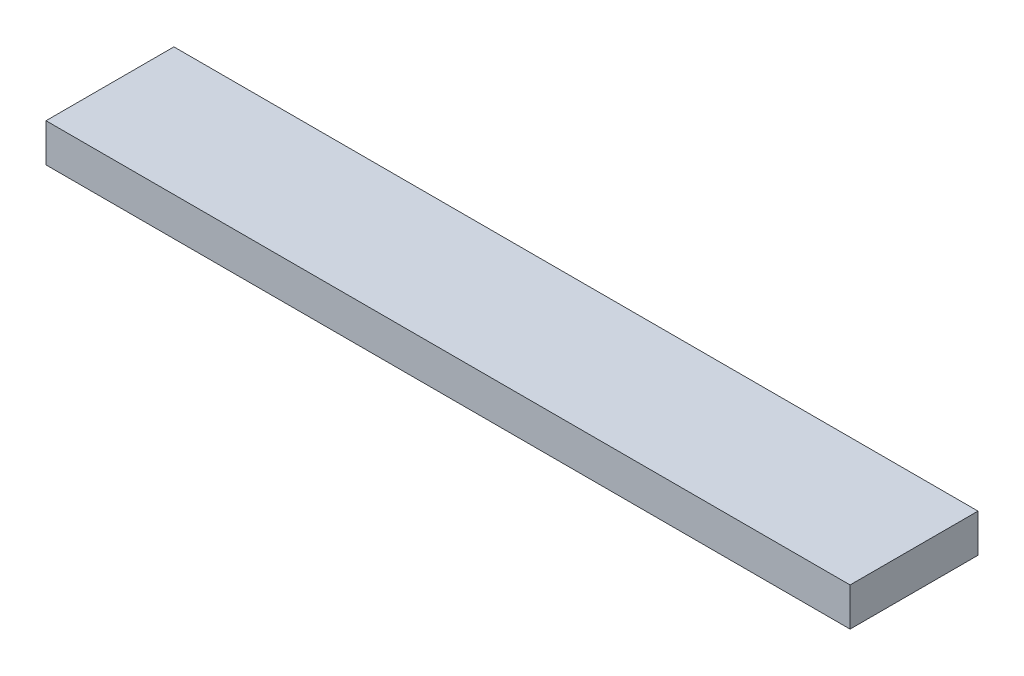
ISO-10303-21;
HEADER;
FILE_DESCRIPTION(('STEP AP214'),'2;1');
FILE_NAME('part.step','',(''),(''),'','','');
FILE_SCHEMA(('AUTOMOTIVE_DESIGN { 1 0 10303 214 1 1 1 1 }'));
ENDSEC;
DATA;
#1=APPLICATION_CONTEXT('core data for automotive mechanical design processes');
#2=APPLICATION_PROTOCOL_DEFINITION('international standard','automotive_design',2000,#1);
#3=PRODUCT_CONTEXT('',#1,'mechanical');
#4=PRODUCT('Part','Part','',(#3));
#5=PRODUCT_RELATED_PRODUCT_CATEGORY('part','',(#4));
#6=PRODUCT_DEFINITION_FORMATION('','',#4);
#7=PRODUCT_DEFINITION_CONTEXT('part definition',#1,'design');
#8=PRODUCT_DEFINITION('design','',#6,#7);
#9=PRODUCT_DEFINITION_SHAPE('','',#8);
#10=(LENGTH_UNIT() NAMED_UNIT(*) SI_UNIT(.MILLI.,.METRE.));
#11=(NAMED_UNIT(*) PLANE_ANGLE_UNIT() SI_UNIT($,.RADIAN.));
#12=(NAMED_UNIT(*) SI_UNIT($,.STERADIAN.) SOLID_ANGLE_UNIT());
#13=UNCERTAINTY_MEASURE_WITH_UNIT(LENGTH_MEASURE(1.E-05),#10,'distance_accuracy_value','');
#14=(GEOMETRIC_REPRESENTATION_CONTEXT(3) GLOBAL_UNCERTAINTY_ASSIGNED_CONTEXT((#13)) GLOBAL_UNIT_ASSIGNED_CONTEXT((#10,
#11,#12)) REPRESENTATION_CONTEXT('',''));
#15=CARTESIAN_POINT('',(0.,0.,0.));
#16=DIRECTION('',(0.,0.,1.));
#17=DIRECTION('',(1.,0.,0.));
#18=AXIS2_PLACEMENT_3D('',#15,#16,#17);
#19=CARTESIAN_POINT('',(-201.,35.9999999999999,536.02351291583));
#20=DIRECTION('',(1.,0.,0.));
#21=DIRECTION('',(0.,0.,-1.));
#22=AXIS2_PLACEMENT_3D('',#19,#20,#21);
#23=PLANE('',#22);
#24=DIRECTION('',(0.,0.,-1.));
#25=VECTOR('',#24,1.);
#26=CARTESIAN_POINT('',(-201.,13.9999999999999,536.02351291583));
#27=LINE('',#26,#25);
#28=CARTESIAN_POINT('',(-201.,13.9999999999999,73.5000000000002));
#29=VERTEX_POINT('',#28);
#30=CARTESIAN_POINT('',(-201.,13.9999999999999,0.));
#31=VERTEX_POINT('',#30);
#32=EDGE_CURVE('E71',#29,#31,#27,.T.);
#33=ORIENTED_EDGE('',*,*,#32,.F.);
#34=DIRECTION('',(0.,1.,0.));
#35=VECTOR('',#34,1.);
#36=CARTESIAN_POINT('',(-201.,36.,73.5000000000002));
#37=LINE('',#36,#35);
#38=CARTESIAN_POINT('',(-201.,35.9999999999999,73.5000000000002));
#39=VERTEX_POINT('',#38);
#40=EDGE_CURVE('E41',#29,#39,#37,.T.);
#41=ORIENTED_EDGE('',*,*,#40,.T.);
#42=DIRECTION('',(0.,0.,-1.));
#43=VECTOR('',#42,1.);
#44=CARTESIAN_POINT('',(-201.,35.9999999999999,536.02351291583));
#45=LINE('',#44,#43);
#46=CARTESIAN_POINT('',(-201.,35.9999999999999,0.));
#47=VERTEX_POINT('',#46);
#48=EDGE_CURVE('E91',#39,#47,#45,.T.);
#49=ORIENTED_EDGE('',*,*,#48,.T.);
#50=DIRECTION('',(0.,-1.,0.));
#51=VECTOR('',#50,1.);
#52=CARTESIAN_POINT('',(-201.,35.9999999999999,0.));
#53=LINE('',#52,#51);
#54=EDGE_CURVE('E85',#47,#31,#53,.T.);
#55=ORIENTED_EDGE('',*,*,#54,.T.);
#56=EDGE_LOOP('',(#33,#41,#49,#55));
#57=FACE_BOUND('',#56,.T.);
#58=ADVANCED_FACE('F34',(#57),#23,.F.);
#59=CARTESIAN_POINT('',(-201.,13.9999999999999,536.02351291583));
#60=DIRECTION('',(0.,1.,0.));
#61=DIRECTION('',(-1.,0.,0.));
#62=AXIS2_PLACEMENT_3D('',#59,#60,#61);
#63=PLANE('',#62);
#64=DIRECTION('',(0.,0.,-1.));
#65=VECTOR('',#64,1.);
#66=CARTESIAN_POINT('',(261.,13.9999999999999,536.02351291583));
#67=LINE('',#66,#65);
#68=CARTESIAN_POINT('',(261.,14.,73.5000000000002));
#69=VERTEX_POINT('',#68);
#70=CARTESIAN_POINT('',(261.,13.9999999999999,0.));
#71=VERTEX_POINT('',#70);
#72=EDGE_CURVE('E80',#69,#71,#67,.T.);
#73=ORIENTED_EDGE('',*,*,#72,.F.);
#74=DIRECTION('',(-1.,0.,0.));
#75=VECTOR('',#74,1.);
#76=CARTESIAN_POINT('',(-201.,13.9999999999999,73.5000000000002));
#77=LINE('',#76,#75);
#78=EDGE_CURVE('E48',#69,#29,#77,.T.);
#79=ORIENTED_EDGE('',*,*,#78,.T.);
#80=ORIENTED_EDGE('',*,*,#32,.T.);
#81=DIRECTION('',(1.,0.,0.));
#82=VECTOR('',#81,1.);
#83=CARTESIAN_POINT('',(-201.,13.9999999999999,0.));
#84=LINE('',#83,#82);
#85=EDGE_CURVE('E75',#31,#71,#84,.T.);
#86=ORIENTED_EDGE('',*,*,#85,.T.);
#87=EDGE_LOOP('',(#73,#79,#80,#86));
#88=FACE_BOUND('',#87,.T.);
#89=ADVANCED_FACE('F74',(#88),#63,.F.);
#90=CARTESIAN_POINT('',(261.,35.9999999999999,536.02351291583));
#91=DIRECTION('',(1.,0.,0.));
#92=DIRECTION('',(0.,0.,-1.));
#93=AXIS2_PLACEMENT_3D('',#90,#91,#92);
#94=PLANE('',#93);
#95=DIRECTION('',(0.,1.,0.));
#96=VECTOR('',#95,1.);
#97=CARTESIAN_POINT('',(261.,36.,73.5000000000002));
#98=LINE('',#97,#96);
#99=CARTESIAN_POINT('',(261.,35.9999999999999,73.5000000000002));
#100=VERTEX_POINT('',#99);
#101=EDGE_CURVE('E79',#69,#100,#98,.T.);
#102=ORIENTED_EDGE('',*,*,#101,.F.);
#103=ORIENTED_EDGE('',*,*,#72,.T.);
#104=DIRECTION('',(0.,-1.,0.));
#105=VECTOR('',#104,1.);
#106=CARTESIAN_POINT('',(261.,35.9999999999999,0.));
#107=LINE('',#106,#105);
#108=CARTESIAN_POINT('',(261.,35.9999999999999,0.));
#109=VERTEX_POINT('',#108);
#110=EDGE_CURVE('E88',#109,#71,#107,.T.);
#111=ORIENTED_EDGE('',*,*,#110,.F.);
#112=DIRECTION('',(0.,0.,-1.));
#113=VECTOR('',#112,1.);
#114=CARTESIAN_POINT('',(261.,35.9999999999999,536.02351291583));
#115=LINE('',#114,#113);
#116=EDGE_CURVE('E100',#100,#109,#115,.T.);
#117=ORIENTED_EDGE('',*,*,#116,.F.);
#118=EDGE_LOOP('',(#102,#103,#111,#117));
#119=FACE_BOUND('',#118,.T.);
#120=ADVANCED_FACE('F103',(#119),#94,.T.);
#121=CARTESIAN_POINT('',(-201.,35.9999999999999,536.02351291583));
#122=DIRECTION('',(0.,1.,0.));
#123=DIRECTION('',(0.,0.,1.));
#124=AXIS2_PLACEMENT_3D('',#121,#122,#123);
#125=PLANE('',#124);
#126=DIRECTION('',(-1.,0.,0.));
#127=VECTOR('',#126,1.);
#128=CARTESIAN_POINT('',(-201.,35.9999999999999,73.5000000000002));
#129=LINE('',#128,#127);
#130=EDGE_CURVE('E11',#100,#39,#129,.T.);
#131=ORIENTED_EDGE('',*,*,#130,.F.);
#132=ORIENTED_EDGE('',*,*,#116,.T.);
#133=DIRECTION('',(1.,0.,0.));
#134=VECTOR('',#133,1.);
#135=CARTESIAN_POINT('',(-201.,35.9999999999999,0.));
#136=LINE('',#135,#134);
#137=EDGE_CURVE('E97',#47,#109,#136,.T.);
#138=ORIENTED_EDGE('',*,*,#137,.F.);
#139=ORIENTED_EDGE('',*,*,#48,.F.);
#140=EDGE_LOOP('',(#131,#132,#138,#139));
#141=FACE_BOUND('',#140,.T.);
#142=ADVANCED_FACE('F107',(#141),#125,.T.);
#143=CARTESIAN_POINT('',(0.,0.,0.));
#144=DIRECTION('',(0.,0.,1.));
#145=DIRECTION('',(1.,0.,0.));
#146=AXIS2_PLACEMENT_3D('',#143,#144,#145);
#147=PLANE('',#146);
#148=ORIENTED_EDGE('',*,*,#54,.F.);
#149=ORIENTED_EDGE('',*,*,#137,.T.);
#150=ORIENTED_EDGE('',*,*,#110,.T.);
#151=ORIENTED_EDGE('',*,*,#85,.F.);
#152=EDGE_LOOP('',(#148,#149,#150,#151));
#153=FACE_BOUND('',#152,.T.);
#154=ADVANCED_FACE('F83',(#153),#147,.F.);
#155=CARTESIAN_POINT('',(30.,-1062.,73.5));
#156=DIRECTION('',(0.,0.,-1.));
#157=DIRECTION('',(0.,1.,0.));
#158=AXIS2_PLACEMENT_3D('',#155,#156,#157);
#159=PLANE('',#158);
#160=ORIENTED_EDGE('',*,*,#78,.F.);
#161=ORIENTED_EDGE('',*,*,#101,.T.);
#162=ORIENTED_EDGE('',*,*,#130,.T.);
#163=ORIENTED_EDGE('',*,*,#40,.F.);
#164=EDGE_LOOP('',(#160,#161,#162,#163));
#165=FACE_BOUND('',#164,.T.);
#166=ADVANCED_FACE('F114',(#165),#159,.F.);
#167=CLOSED_SHELL('',(#58,#89,#120,#142,#154,#166));
#168=MANIFOLD_SOLID_BREP('B2',#167);
#169=ADVANCED_BREP_SHAPE_REPRESENTATION('',(#18,#168),#14);
#170=SHAPE_DEFINITION_REPRESENTATION(#9,#169);
ENDSEC;
END-ISO-10303-21;
